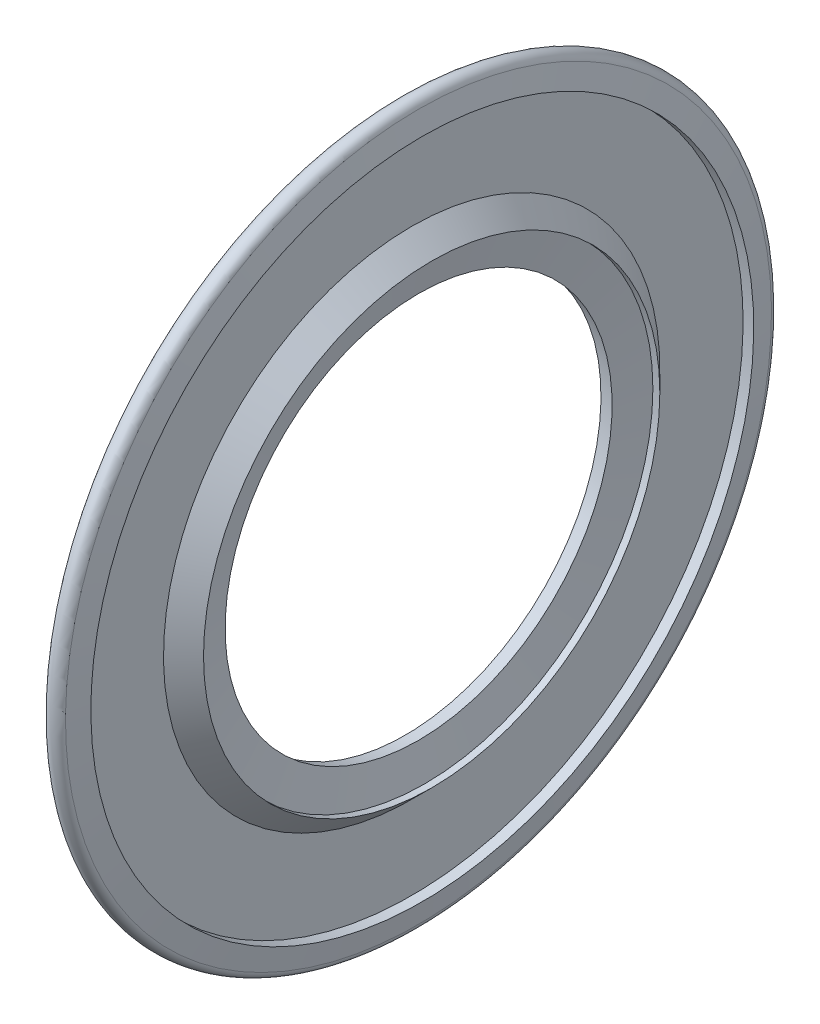
ISO-10303-21;
HEADER;
FILE_DESCRIPTION(('STEP AP214'),'2;1');
FILE_NAME('part.step','',(''),(''),'','','');
FILE_SCHEMA(('AUTOMOTIVE_DESIGN { 1 0 10303 214 1 1 1 1 }'));
ENDSEC;
DATA;
#1=APPLICATION_CONTEXT('core data for automotive mechanical design processes');
#2=APPLICATION_PROTOCOL_DEFINITION('international standard','automotive_design',2000,#1);
#3=PRODUCT_CONTEXT('',#1,'mechanical');
#4=PRODUCT('Part','Part','',(#3));
#5=PRODUCT_RELATED_PRODUCT_CATEGORY('part','',(#4));
#6=PRODUCT_DEFINITION_FORMATION('','',#4);
#7=PRODUCT_DEFINITION_CONTEXT('part definition',#1,'design');
#8=PRODUCT_DEFINITION('design','',#6,#7);
#9=PRODUCT_DEFINITION_SHAPE('','',#8);
#10=(LENGTH_UNIT() NAMED_UNIT(*) SI_UNIT(.MILLI.,.METRE.));
#11=(NAMED_UNIT(*) PLANE_ANGLE_UNIT() SI_UNIT($,.RADIAN.));
#12=(NAMED_UNIT(*) SI_UNIT($,.STERADIAN.) SOLID_ANGLE_UNIT());
#13=UNCERTAINTY_MEASURE_WITH_UNIT(LENGTH_MEASURE(1.E-05),#10,'distance_accuracy_value','');
#14=(GEOMETRIC_REPRESENTATION_CONTEXT(3) GLOBAL_UNCERTAINTY_ASSIGNED_CONTEXT((#13)) GLOBAL_UNIT_ASSIGNED_CONTEXT((#10,
#11,#12)) REPRESENTATION_CONTEXT('',''));
#15=CARTESIAN_POINT('',(0.,0.,0.));
#16=DIRECTION('',(0.,0.,1.));
#17=DIRECTION('',(1.,0.,0.));
#18=AXIS2_PLACEMENT_3D('',#15,#16,#17);
#19=CARTESIAN_POINT('',(0.483,0.,0.));
#20=DIRECTION('',(-1.,0.,0.));
#21=DIRECTION('',(0.,1.,0.));
#22=AXIS2_PLACEMENT_3D('',#19,#20,#21);
#23=CONICAL_SURFACE('',#22,6.264641465067,0.17453292519943);
#24=CARTESIAN_POINT('',(0.7,0.,0.));
#25=DIRECTION('',(1.,0.,0.));
#26=DIRECTION('',(0.,1.,0.));
#27=AXIS2_PLACEMENT_3D('',#24,#25,#26);
#28=CIRCLE('',#27,6.22637851025326);
#29=CARTESIAN_POINT('',(0.7,6.22637851025326,0.));
#30=VERTEX_POINT('',#29);
#31=EDGE_CURVE('E11',#30,#30,#28,.T.);
#32=ORIENTED_EDGE('',*,*,#31,.T.);
#33=EDGE_LOOP('',(#32));
#34=FACE_BOUND('',#33,.T.);
#35=CARTESIAN_POINT('',(0.266,0.,0.));
#36=DIRECTION('',(1.,0.,0.));
#37=DIRECTION('',(0.,1.,0.));
#38=AXIS2_PLACEMENT_3D('',#35,#36,#37);
#39=CIRCLE('',#38,6.30290441988073);
#40=CARTESIAN_POINT('',(0.266,6.30290441988073,0.));
#41=VERTEX_POINT('',#40);
#42=EDGE_CURVE('E70',#41,#41,#39,.T.);
#43=ORIENTED_EDGE('',*,*,#42,.F.);
#44=EDGE_LOOP('',(#43));
#45=FACE_BOUND('',#44,.T.);
#46=ADVANCED_FACE('F16',(#34,#45),#23,.F.);
#47=CARTESIAN_POINT('',(0.798335043577674,0.,0.));
#48=DIRECTION('',(1.,0.,0.));
#49=DIRECTION('',(0.,1.,0.));
#50=AXIS2_PLACEMENT_3D('',#47,#48,#49);
#51=CONICAL_SURFACE('',#50,6.78406425512663,1.39626340159546);
#52=CARTESIAN_POINT('',(0.896670087155346,0.,0.));
#53=DIRECTION('',(1.,0.,0.));
#54=DIRECTION('',(0.,1.,0.));
#55=AXIS2_PLACEMENT_3D('',#52,#53,#54);
#56=CIRCLE('',#55,7.34175);
#57=CARTESIAN_POINT('',(0.896670087155346,7.34175,0.));
#58=VERTEX_POINT('',#57);
#59=EDGE_CURVE('E26',#58,#58,#56,.T.);
#60=ORIENTED_EDGE('',*,*,#59,.T.);
#61=EDGE_LOOP('',(#60));
#62=FACE_BOUND('',#61,.T.);
#63=ORIENTED_EDGE('',*,*,#31,.F.);
#64=EDGE_LOOP('',(#63));
#65=FACE_BOUND('',#64,.T.);
#66=ADVANCED_FACE('F121',(#62,#65),#51,.F.);
#67=CARTESIAN_POINT('',(1.00833504357767,0.,0.));
#68=DIRECTION('',(-1.,0.,0.));
#69=DIRECTION('',(0.,1.,0.));
#70=AXIS2_PLACEMENT_3D('',#67,#68,#69);
#71=CYLINDRICAL_SURFACE('',#70,7.34175);
#72=CARTESIAN_POINT('',(1.12,0.,0.));
#73=DIRECTION('',(1.,0.,0.));
#74=DIRECTION('',(0.,1.,0.));
#75=AXIS2_PLACEMENT_3D('',#72,#73,#74);
#76=CIRCLE('',#75,7.34175);
#77=CARTESIAN_POINT('',(1.12,7.34175,0.));
#78=VERTEX_POINT('',#77);
#79=EDGE_CURVE('E82',#78,#78,#76,.T.);
#80=ORIENTED_EDGE('',*,*,#79,.T.);
#81=EDGE_LOOP('',(#80));
#82=FACE_BOUND('',#81,.T.);
#83=ORIENTED_EDGE('',*,*,#59,.F.);
#84=EDGE_LOOP('',(#83));
#85=FACE_BOUND('',#84,.T.);
#86=ADVANCED_FACE('F126',(#82,#85),#71,.F.);
#87=CARTESIAN_POINT('',(0.798,0.,0.));
#88=DIRECTION('',(-1.,0.,0.));
#89=DIRECTION('',(0.,1.,0.));
#90=AXIS2_PLACEMENT_3D('',#87,#88,#89);
#91=CONICAL_SURFACE('',#90,7.66375,0.785398163397448);
#92=CARTESIAN_POINT('',(0.476,0.,0.));
#93=DIRECTION('',(1.,0.,0.));
#94=DIRECTION('',(0.,1.,0.));
#95=AXIS2_PLACEMENT_3D('',#92,#93,#94);
#96=CIRCLE('',#95,7.98575);
#97=CARTESIAN_POINT('',(0.476,7.98575,0.));
#98=VERTEX_POINT('',#97);
#99=EDGE_CURVE('E56',#98,#98,#96,.T.);
#100=ORIENTED_EDGE('',*,*,#99,.T.);
#101=EDGE_LOOP('',(#100));
#102=FACE_BOUND('',#101,.T.);
#103=ORIENTED_EDGE('',*,*,#79,.F.);
#104=EDGE_LOOP('',(#103));
#105=FACE_BOUND('',#104,.T.);
#106=ADVANCED_FACE('F137',(#102,#105),#91,.T.);
#107=CARTESIAN_POINT('',(0.476,9.3254575,0.));
#108=DIRECTION('',(1.,0.,0.));
#109=DIRECTION('',(0.,1.,0.));
#110=AXIS2_PLACEMENT_3D('',#107,#108,#109);
#111=PLANE('',#110);
#112=CARTESIAN_POINT('',(0.476,0.,0.));
#113=DIRECTION('',(1.,0.,0.));
#114=DIRECTION('',(0.,1.,0.));
#115=AXIS2_PLACEMENT_3D('',#112,#113,#114);
#116=CIRCLE('',#115,10.665165);
#117=CARTESIAN_POINT('',(0.476,10.665165,0.));
#118=VERTEX_POINT('',#117);
#119=EDGE_CURVE('E20',#118,#118,#116,.T.);
#120=ORIENTED_EDGE('',*,*,#119,.T.);
#121=EDGE_LOOP('',(#120));
#122=FACE_BOUND('',#121,.T.);
#123=ORIENTED_EDGE('',*,*,#99,.F.);
#124=EDGE_LOOP('',(#123));
#125=FACE_BOUND('',#124,.T.);
#126=ADVANCED_FACE('F117',(#122,#125),#111,.T.);
#127=CARTESIAN_POINT('',(0.647125242504037,0.,0.));
#128=DIRECTION('',(-1.,0.,0.));
#129=DIRECTION('',(0.,1.,0.));
#130=AXIS2_PLACEMENT_3D('',#127,#128,#129);
#131=CYLINDRICAL_SURFACE('',#130,10.665165);
#132=CARTESIAN_POINT('',(0.818250485008074,0.,0.));
#133=DIRECTION('',(1.,0.,0.));
#134=DIRECTION('',(0.,1.,0.));
#135=AXIS2_PLACEMENT_3D('',#132,#133,#134);
#136=CIRCLE('',#135,10.665165);
#137=CARTESIAN_POINT('',(0.818250485008074,10.665165,0.));
#138=VERTEX_POINT('',#137);
#139=EDGE_CURVE('E97',#138,#138,#136,.T.);
#140=ORIENTED_EDGE('',*,*,#139,.T.);
#141=EDGE_LOOP('',(#140));
#142=FACE_BOUND('',#141,.T.);
#143=ORIENTED_EDGE('',*,*,#119,.F.);
#144=EDGE_LOOP('',(#143));
#145=FACE_BOUND('',#144,.T.);
#146=ADVANCED_FACE('F101',(#142,#145),#131,.F.);
#147=CARTESIAN_POINT('',(0.756998327925746,0.,0.));
#148=DIRECTION('',(-1.,0.,0.));
#149=DIRECTION('',(0.,1.,0.));
#150=AXIS2_PLACEMENT_3D('',#147,#148,#149);
#151=CONICAL_SURFACE('',#150,11.0125432448734,1.39626340159546);
#152=CARTESIAN_POINT('',(0.695746170843419,0.,0.));
#153=DIRECTION('',(1.,0.,0.));
#154=DIRECTION('',(0.,1.,0.));
#155=AXIS2_PLACEMENT_3D('',#152,#153,#154);
#156=CIRCLE('',#155,11.3599214897467);
#157=CARTESIAN_POINT('',(0.695746170843419,11.3599214897467,0.));
#158=VERTEX_POINT('',#157);
#159=EDGE_CURVE('E95',#158,#158,#156,.T.);
#160=ORIENTED_EDGE('',*,*,#159,.T.);
#161=EDGE_LOOP('',(#160));
#162=FACE_BOUND('',#161,.T.);
#163=ORIENTED_EDGE('',*,*,#139,.F.);
#164=EDGE_LOOP('',(#163));
#165=FACE_BOUND('',#164,.T.);
#166=ADVANCED_FACE('F104',(#162,#165),#151,.T.);
#167=CARTESIAN_POINT('',(0.42,0.,0.));
#168=DIRECTION('',(1.,0.,0.));
#169=DIRECTION('',(0.,0.,-1.));
#170=AXIS2_PLACEMENT_3D('',#167,#168,#169);
#171=TOROIDAL_SURFACE('',#170,11.3113,0.28);
#172=CARTESIAN_POINT('',(0.177512886940357,0.,0.));
#173=DIRECTION('',(1.,0.,0.));
#174=DIRECTION('',(0.,1.,0.));
#175=AXIS2_PLACEMENT_3D('',#172,#173,#174);
#176=CIRCLE('',#175,11.4513);
#177=CARTESIAN_POINT('',(0.177512886940357,11.4513,0.));
#178=VERTEX_POINT('',#177);
#179=EDGE_CURVE('E89',#178,#178,#176,.T.);
#180=ORIENTED_EDGE('',*,*,#179,.T.);
#181=EDGE_LOOP('',(#180));
#182=FACE_BOUND('',#181,.T.);
#183=ORIENTED_EDGE('',*,*,#159,.F.);
#184=EDGE_LOOP('',(#183));
#185=FACE_BOUND('',#184,.T.);
#186=ADVANCED_FACE('F106',(#182,#185),#171,.T.);
#187=CARTESIAN_POINT('',(0.177512886940357,11.2273,0.));
#188=DIRECTION('',(-1.,0.,0.));
#189=DIRECTION('',(0.,-1.,0.));
#190=AXIS2_PLACEMENT_3D('',#187,#188,#189);
#191=PLANE('',#190);
#192=CARTESIAN_POINT('',(0.177512886940357,0.,0.));
#193=DIRECTION('',(1.,0.,0.));
#194=DIRECTION('',(0.,1.,0.));
#195=AXIS2_PLACEMENT_3D('',#192,#193,#194);
#196=CIRCLE('',#195,11.0033);
#197=CARTESIAN_POINT('',(0.177512886940357,11.0033,0.));
#198=VERTEX_POINT('',#197);
#199=EDGE_CURVE('E86',#198,#198,#196,.T.);
#200=ORIENTED_EDGE('',*,*,#199,.T.);
#201=EDGE_LOOP('',(#200));
#202=FACE_BOUND('',#201,.T.);
#203=ORIENTED_EDGE('',*,*,#179,.F.);
#204=EDGE_LOOP('',(#203));
#205=FACE_BOUND('',#204,.T.);
#206=ADVANCED_FACE('F114',(#202,#205),#191,.T.);
#207=CARTESIAN_POINT('',(0.116756443470179,0.,0.));
#208=DIRECTION('',(1.,0.,0.));
#209=DIRECTION('',(0.,1.,0.));
#210=AXIS2_PLACEMENT_3D('',#207,#208,#209);
#211=CONICAL_SURFACE('',#210,10.9425435565298,0.785398163397455);
#212=CARTESIAN_POINT('',(0.056,0.,0.));
#213=DIRECTION('',(1.,0.,0.));
#214=DIRECTION('',(0.,1.,0.));
#215=AXIS2_PLACEMENT_3D('',#212,#213,#214);
#216=CIRCLE('',#215,10.8817871130596);
#217=CARTESIAN_POINT('',(0.056,10.8817871130596,0.));
#218=VERTEX_POINT('',#217);
#219=EDGE_CURVE('E85',#218,#218,#216,.T.);
#220=ORIENTED_EDGE('',*,*,#219,.T.);
#221=EDGE_LOOP('',(#220));
#222=FACE_BOUND('',#221,.T.);
#223=ORIENTED_EDGE('',*,*,#199,.F.);
#224=EDGE_LOOP('',(#223));
#225=FACE_BOUND('',#224,.T.);
#226=ADVANCED_FACE('F132',(#222,#225),#211,.T.);
#227=CARTESIAN_POINT('',(0.056,9.11176855652982,0.));
#228=DIRECTION('',(-1.,0.,0.));
#229=DIRECTION('',(0.,-1.,0.));
#230=AXIS2_PLACEMENT_3D('',#227,#228,#229);
#231=PLANE('',#230);
#232=CARTESIAN_POINT('',(0.056,0.,0.));
#233=DIRECTION('',(1.,0.,0.));
#234=DIRECTION('',(0.,1.,0.));
#235=AXIS2_PLACEMENT_3D('',#232,#233,#234);
#236=CIRCLE('',#235,7.34175);
#237=CARTESIAN_POINT('',(0.056,7.34175,0.));
#238=VERTEX_POINT('',#237);
#239=EDGE_CURVE('E79',#238,#238,#236,.T.);
#240=ORIENTED_EDGE('',*,*,#239,.T.);
#241=EDGE_LOOP('',(#240));
#242=FACE_BOUND('',#241,.T.);
#243=ORIENTED_EDGE('',*,*,#219,.F.);
#244=EDGE_LOOP('',(#243));
#245=FACE_BOUND('',#244,.T.);
#246=ADVANCED_FACE('F18',(#242,#245),#231,.T.);
#247=CARTESIAN_POINT('',(0.161,0.,0.));
#248=DIRECTION('',(-1.,0.,0.));
#249=DIRECTION('',(0.,1.,0.));
#250=AXIS2_PLACEMENT_3D('',#247,#248,#249);
#251=CYLINDRICAL_SURFACE('',#250,7.34175);
#252=CARTESIAN_POINT('',(0.266,0.,0.));
#253=DIRECTION('',(1.,0.,0.));
#254=DIRECTION('',(0.,1.,0.));
#255=AXIS2_PLACEMENT_3D('',#252,#253,#254);
#256=CIRCLE('',#255,7.34175);
#257=CARTESIAN_POINT('',(0.266,7.34175,0.));
#258=VERTEX_POINT('',#257);
#259=EDGE_CURVE('E74',#258,#258,#256,.T.);
#260=ORIENTED_EDGE('',*,*,#259,.T.);
#261=EDGE_LOOP('',(#260));
#262=FACE_BOUND('',#261,.T.);
#263=ORIENTED_EDGE('',*,*,#239,.F.);
#264=EDGE_LOOP('',(#263));
#265=FACE_BOUND('',#264,.T.);
#266=ADVANCED_FACE('F75',(#262,#265),#251,.F.);
#267=CARTESIAN_POINT('',(0.266,6.82232720994037,0.));
#268=DIRECTION('',(-1.,0.,0.));
#269=DIRECTION('',(0.,-1.,0.));
#270=AXIS2_PLACEMENT_3D('',#267,#268,#269);
#271=PLANE('',#270);
#272=ORIENTED_EDGE('',*,*,#42,.T.);
#273=EDGE_LOOP('',(#272));
#274=FACE_BOUND('',#273,.T.);
#275=ORIENTED_EDGE('',*,*,#259,.F.);
#276=EDGE_LOOP('',(#275));
#277=FACE_BOUND('',#276,.T.);
#278=ADVANCED_FACE('F131',(#274,#277),#271,.T.);
#279=CLOSED_SHELL('',(#46,#66,#86,#106,#126,#146,#166,#186,#206,#226,#246,#266,#278));
#280=MANIFOLD_SOLID_BREP('B1',#279);
#281=ADVANCED_BREP_SHAPE_REPRESENTATION('',(#18,#280),#14);
#282=SHAPE_DEFINITION_REPRESENTATION(#9,#281);
ENDSEC;
END-ISO-10303-21;
